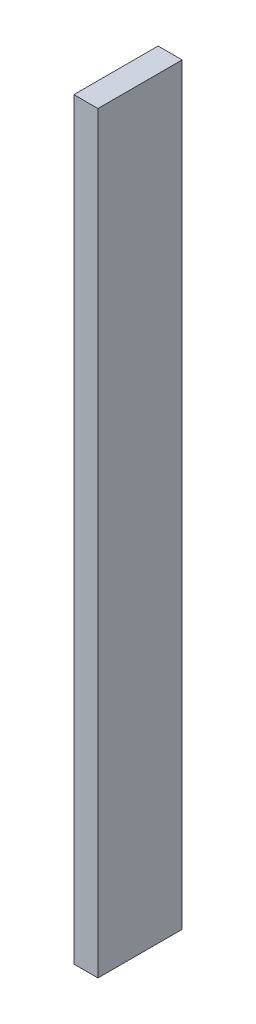
ISO-10303-21;
HEADER;
FILE_DESCRIPTION(('STEP AP214'),'2;1');
FILE_NAME('part.step','',(''),(''),'','','');
FILE_SCHEMA(('AUTOMOTIVE_DESIGN { 1 0 10303 214 1 1 1 1 }'));
ENDSEC;
DATA;
#1=APPLICATION_CONTEXT('core data for automotive mechanical design processes');
#2=APPLICATION_PROTOCOL_DEFINITION('international standard','automotive_design',2000,#1);
#3=PRODUCT_CONTEXT('',#1,'mechanical');
#4=PRODUCT('Part','Part','',(#3));
#5=PRODUCT_RELATED_PRODUCT_CATEGORY('part','',(#4));
#6=PRODUCT_DEFINITION_FORMATION('','',#4);
#7=PRODUCT_DEFINITION_CONTEXT('part definition',#1,'design');
#8=PRODUCT_DEFINITION('design','',#6,#7);
#9=PRODUCT_DEFINITION_SHAPE('','',#8);
#10=(LENGTH_UNIT() NAMED_UNIT(*) SI_UNIT(.MILLI.,.METRE.));
#11=(NAMED_UNIT(*) PLANE_ANGLE_UNIT() SI_UNIT($,.RADIAN.));
#12=(NAMED_UNIT(*) SI_UNIT($,.STERADIAN.) SOLID_ANGLE_UNIT());
#13=UNCERTAINTY_MEASURE_WITH_UNIT(LENGTH_MEASURE(1.E-05),#10,'distance_accuracy_value','');
#14=(GEOMETRIC_REPRESENTATION_CONTEXT(3) GLOBAL_UNCERTAINTY_ASSIGNED_CONTEXT((#13)) GLOBAL_UNIT_ASSIGNED_CONTEXT((#10,
#11,#12)) REPRESENTATION_CONTEXT('',''));
#15=CARTESIAN_POINT('',(0.,0.,0.));
#16=DIRECTION('',(0.,0.,1.));
#17=DIRECTION('',(1.,0.,0.));
#18=AXIS2_PLACEMENT_3D('',#15,#16,#17);
#19=CARTESIAN_POINT('',(52.6500000000011,157.,35.));
#20=DIRECTION('',(0.,1.,0.));
#21=DIRECTION('',(-1.,0.,0.));
#22=AXIS2_PLACEMENT_3D('',#19,#20,#21);
#23=PLANE('',#22);
#24=DIRECTION('',(1.,0.,0.));
#25=VECTOR('',#24,1.);
#26=CARTESIAN_POINT('',(52.6500000000011,157.,0.));
#27=LINE('',#26,#25);
#28=CARTESIAN_POINT('',(52.6500000000011,157.,0.));
#29=VERTEX_POINT('',#28);
#30=CARTESIAN_POINT('',(62.6500000000011,157.,0.));
#31=VERTEX_POINT('',#30);
#32=EDGE_CURVE('E99',#29,#31,#27,.T.);
#33=ORIENTED_EDGE('',*,*,#32,.F.);
#34=DIRECTION('',(0.,0.,-1.));
#35=VECTOR('',#34,1.);
#36=CARTESIAN_POINT('',(52.6500000000011,157.,35.));
#37=LINE('',#36,#35);
#38=CARTESIAN_POINT('',(52.6500000000011,157.,35.));
#39=VERTEX_POINT('',#38);
#40=EDGE_CURVE('E11',#39,#29,#37,.T.);
#41=ORIENTED_EDGE('',*,*,#40,.F.);
#42=DIRECTION('',(1.,0.,0.));
#43=VECTOR('',#42,1.);
#44=CARTESIAN_POINT('',(52.6500000000011,157.,35.));
#45=LINE('',#44,#43);
#46=CARTESIAN_POINT('',(62.6500000000011,157.,35.));
#47=VERTEX_POINT('',#46);
#48=EDGE_CURVE('E94',#39,#47,#45,.T.);
#49=ORIENTED_EDGE('',*,*,#48,.T.);
#50=DIRECTION('',(0.,0.,-1.));
#51=VECTOR('',#50,1.);
#52=CARTESIAN_POINT('',(62.6500000000011,157.,35.));
#53=LINE('',#52,#51);
#54=EDGE_CURVE('E37',#47,#31,#53,.T.);
#55=ORIENTED_EDGE('',*,*,#54,.T.);
#56=EDGE_LOOP('',(#33,#41,#49,#55));
#57=FACE_BOUND('',#56,.T.);
#58=ADVANCED_FACE('F34',(#57),#23,.T.);
#59=CARTESIAN_POINT('',(52.6500000000011,157.,35.));
#60=DIRECTION('',(1.,0.,0.));
#61=DIRECTION('',(0.,1.,0.));
#62=AXIS2_PLACEMENT_3D('',#59,#60,#61);
#63=PLANE('',#62);
#64=DIRECTION('',(0.,-1.,0.));
#65=VECTOR('',#64,1.);
#66=CARTESIAN_POINT('',(52.6500000000011,157.,0.));
#67=LINE('',#66,#65);
#68=CARTESIAN_POINT('',(52.6500000000011,-156.,0.));
#69=VERTEX_POINT('',#68);
#70=EDGE_CURVE('E67',#29,#69,#67,.T.);
#71=ORIENTED_EDGE('',*,*,#70,.T.);
#72=DIRECTION('',(0.,0.,-1.));
#73=VECTOR('',#72,1.);
#74=CARTESIAN_POINT('',(52.6500000000011,-156.,35.));
#75=LINE('',#74,#73);
#76=CARTESIAN_POINT('',(52.6500000000011,-156.,35.));
#77=VERTEX_POINT('',#76);
#78=EDGE_CURVE('E43',#77,#69,#75,.T.);
#79=ORIENTED_EDGE('',*,*,#78,.F.);
#80=DIRECTION('',(0.,-1.,0.));
#81=VECTOR('',#80,1.);
#82=CARTESIAN_POINT('',(52.6500000000011,157.,35.));
#83=LINE('',#82,#81);
#84=EDGE_CURVE('E84',#39,#77,#83,.T.);
#85=ORIENTED_EDGE('',*,*,#84,.F.);
#86=ORIENTED_EDGE('',*,*,#40,.T.);
#87=EDGE_LOOP('',(#71,#79,#85,#86));
#88=FACE_BOUND('',#87,.T.);
#89=ADVANCED_FACE('F109',(#88),#63,.F.);
#90=CARTESIAN_POINT('',(52.6500000000011,-156.,35.));
#91=DIRECTION('',(0.,1.,0.));
#92=DIRECTION('',(0.,0.,1.));
#93=AXIS2_PLACEMENT_3D('',#90,#91,#92);
#94=PLANE('',#93);
#95=DIRECTION('',(1.,0.,0.));
#96=VECTOR('',#95,1.);
#97=CARTESIAN_POINT('',(52.6500000000011,-156.,0.));
#98=LINE('',#97,#96);
#99=CARTESIAN_POINT('',(62.6500000000011,-156.,0.));
#100=VERTEX_POINT('',#99);
#101=EDGE_CURVE('E91',#69,#100,#98,.T.);
#102=ORIENTED_EDGE('',*,*,#101,.T.);
#103=DIRECTION('',(0.,0.,-1.));
#104=VECTOR('',#103,1.);
#105=CARTESIAN_POINT('',(62.6500000000011,-156.,35.));
#106=LINE('',#105,#104);
#107=CARTESIAN_POINT('',(62.6500000000011,-156.,35.));
#108=VERTEX_POINT('',#107);
#109=EDGE_CURVE('E88',#108,#100,#106,.T.);
#110=ORIENTED_EDGE('',*,*,#109,.F.);
#111=DIRECTION('',(1.,0.,0.));
#112=VECTOR('',#111,1.);
#113=CARTESIAN_POINT('',(52.6500000000011,-156.,35.));
#114=LINE('',#113,#112);
#115=EDGE_CURVE('E79',#77,#108,#114,.T.);
#116=ORIENTED_EDGE('',*,*,#115,.F.);
#117=ORIENTED_EDGE('',*,*,#78,.T.);
#118=EDGE_LOOP('',(#102,#110,#116,#117));
#119=FACE_BOUND('',#118,.T.);
#120=ADVANCED_FACE('F89',(#119),#94,.F.);
#121=CARTESIAN_POINT('',(62.6500000000011,157.,35.));
#122=DIRECTION('',(1.,0.,0.));
#123=DIRECTION('',(0.,1.,0.));
#124=AXIS2_PLACEMENT_3D('',#121,#122,#123);
#125=PLANE('',#124);
#126=DIRECTION('',(0.,-1.,0.));
#127=VECTOR('',#126,1.);
#128=CARTESIAN_POINT('',(62.6500000000011,157.,0.));
#129=LINE('',#128,#127);
#130=EDGE_CURVE('E102',#31,#100,#129,.T.);
#131=ORIENTED_EDGE('',*,*,#130,.F.);
#132=ORIENTED_EDGE('',*,*,#54,.F.);
#133=DIRECTION('',(0.,-1.,0.));
#134=VECTOR('',#133,1.);
#135=CARTESIAN_POINT('',(62.6500000000011,157.,35.));
#136=LINE('',#135,#134);
#137=EDGE_CURVE('E83',#47,#108,#136,.T.);
#138=ORIENTED_EDGE('',*,*,#137,.T.);
#139=ORIENTED_EDGE('',*,*,#109,.T.);
#140=EDGE_LOOP('',(#131,#132,#138,#139));
#141=FACE_BOUND('',#140,.T.);
#142=ADVANCED_FACE('F93',(#141),#125,.T.);
#143=CARTESIAN_POINT('',(0.,0.,35.));
#144=DIRECTION('',(0.,0.,-1.));
#145=DIRECTION('',(-1.,0.,0.));
#146=AXIS2_PLACEMENT_3D('',#143,#144,#145);
#147=PLANE('',#146);
#148=ORIENTED_EDGE('',*,*,#48,.F.);
#149=ORIENTED_EDGE('',*,*,#84,.T.);
#150=ORIENTED_EDGE('',*,*,#115,.T.);
#151=ORIENTED_EDGE('',*,*,#137,.F.);
#152=EDGE_LOOP('',(#148,#149,#150,#151));
#153=FACE_BOUND('',#152,.T.);
#154=ADVANCED_FACE('F82',(#153),#147,.F.);
#155=CARTESIAN_POINT('',(0.,0.,0.));
#156=DIRECTION('',(0.,0.,-1.));
#157=DIRECTION('',(-1.,0.,0.));
#158=AXIS2_PLACEMENT_3D('',#155,#156,#157);
#159=PLANE('',#158);
#160=ORIENTED_EDGE('',*,*,#32,.T.);
#161=ORIENTED_EDGE('',*,*,#130,.T.);
#162=ORIENTED_EDGE('',*,*,#101,.F.);
#163=ORIENTED_EDGE('',*,*,#70,.F.);
#164=EDGE_LOOP('',(#160,#161,#162,#163));
#165=FACE_BOUND('',#164,.T.);
#166=ADVANCED_FACE('F107',(#165),#159,.T.);
#167=CLOSED_SHELL('',(#58,#89,#120,#142,#154,#166));
#168=MANIFOLD_SOLID_BREP('B2',#167);
#169=ADVANCED_BREP_SHAPE_REPRESENTATION('',(#18,#168),#14);
#170=SHAPE_DEFINITION_REPRESENTATION(#9,#169);
ENDSEC;
END-ISO-10303-21;
